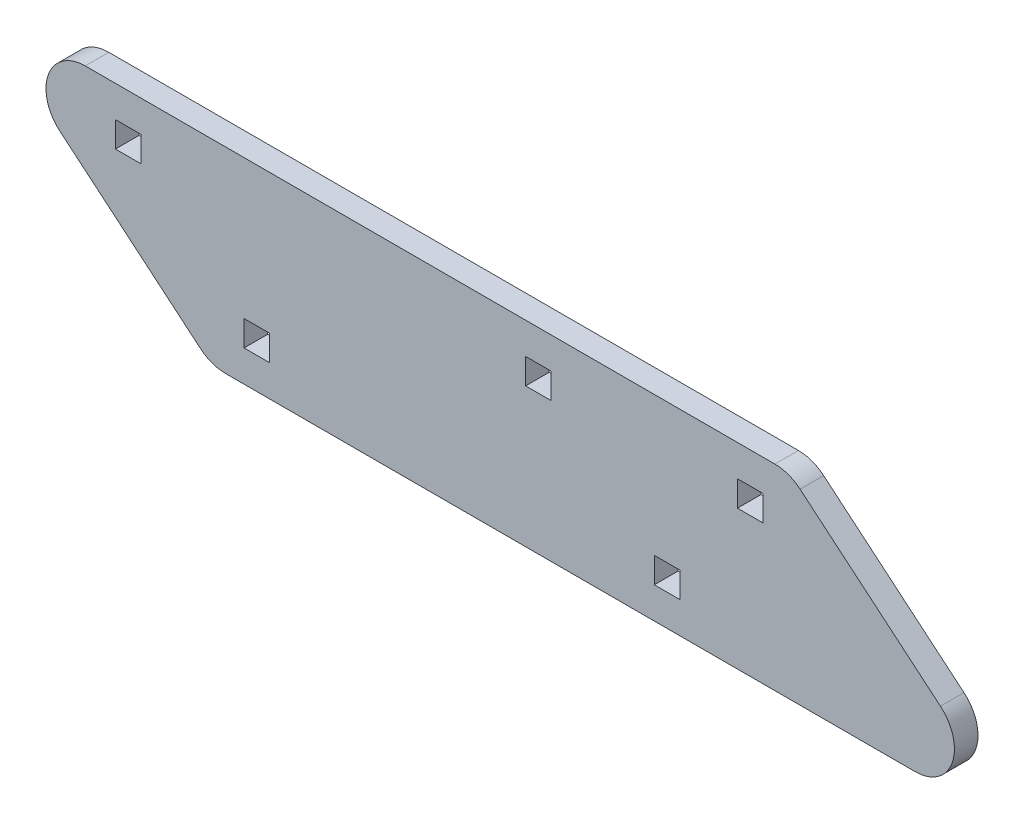
ISO-10303-21;
HEADER;
FILE_DESCRIPTION(('STEP AP214'),'2;1');
FILE_NAME('part.step','',(''),(''),'','','');
FILE_SCHEMA(('AUTOMOTIVE_DESIGN { 1 0 10303 214 1 1 1 1 }'));
ENDSEC;
DATA;
#1=APPLICATION_CONTEXT('core data for automotive mechanical design processes');
#2=APPLICATION_PROTOCOL_DEFINITION('international standard','automotive_design',2000,#1);
#3=PRODUCT_CONTEXT('',#1,'mechanical');
#4=PRODUCT('Part','Part','',(#3));
#5=PRODUCT_RELATED_PRODUCT_CATEGORY('part','',(#4));
#6=PRODUCT_DEFINITION_FORMATION('','',#4);
#7=PRODUCT_DEFINITION_CONTEXT('part definition',#1,'design');
#8=PRODUCT_DEFINITION('design','',#6,#7);
#9=PRODUCT_DEFINITION_SHAPE('','',#8);
#10=(LENGTH_UNIT() NAMED_UNIT(*) SI_UNIT(.MILLI.,.METRE.));
#11=(NAMED_UNIT(*) PLANE_ANGLE_UNIT() SI_UNIT($,.RADIAN.));
#12=(NAMED_UNIT(*) SI_UNIT($,.STERADIAN.) SOLID_ANGLE_UNIT());
#13=UNCERTAINTY_MEASURE_WITH_UNIT(LENGTH_MEASURE(1.E-05),#10,'distance_accuracy_value','');
#14=(GEOMETRIC_REPRESENTATION_CONTEXT(3) GLOBAL_UNCERTAINTY_ASSIGNED_CONTEXT((#13)) GLOBAL_UNIT_ASSIGNED_CONTEXT((#10,
#11,#12)) REPRESENTATION_CONTEXT('',''));
#15=CARTESIAN_POINT('',(0.,0.,0.));
#16=DIRECTION('',(0.,0.,1.));
#17=DIRECTION('',(1.,0.,0.));
#18=AXIS2_PLACEMENT_3D('',#15,#16,#17);
#19=CARTESIAN_POINT('',(74.7329856296232,13.7000000000001,56.0000000000001));
#20=DIRECTION('',(0.,-1.,0.));
#21=DIRECTION('',(0.,0.,1.));
#22=AXIS2_PLACEMENT_3D('',#19,#20,#21);
#23=PLANE('',#22);
#24=DIRECTION('',(-1.,0.,0.));
#25=VECTOR('',#24,1.);
#26=CARTESIAN_POINT('',(74.7329856296231,13.7,62.0000000000001));
#27=LINE('',#26,#25);
#28=CARTESIAN_POINT('',(11.5056036572506,13.7,62.0000000000001));
#29=VERTEX_POINT('',#28);
#30=CARTESIAN_POINT('',(-164.19224017583,13.7,62.0000000000001));
#31=VERTEX_POINT('',#30);
#32=EDGE_CURVE('E449',#29,#31,#27,.T.);
#33=ORIENTED_EDGE('',*,*,#32,.F.);
#34=DIRECTION('',(0.,0.,-1.));
#35=VECTOR('',#34,1.);
#36=CARTESIAN_POINT('',(11.5056036572506,13.7,62.0000000000001));
#37=LINE('',#36,#35);
#38=CARTESIAN_POINT('',(11.5056036572506,13.7000000000001,56.));
#39=VERTEX_POINT('',#38);
#40=EDGE_CURVE('E523',#39,#29,#37,.F.);
#41=ORIENTED_EDGE('',*,*,#40,.F.);
#42=DIRECTION('',(-1.,0.,0.));
#43=VECTOR('',#42,1.);
#44=CARTESIAN_POINT('',(74.7329856296232,13.7000000000001,56.0000000000001));
#45=LINE('',#44,#43);
#46=CARTESIAN_POINT('',(-164.19224017583,13.7,56.0000000000001));
#47=VERTEX_POINT('',#46);
#48=EDGE_CURVE('E461',#39,#47,#45,.T.);
#49=ORIENTED_EDGE('',*,*,#48,.T.);
#50=DIRECTION('',(0.,0.,-1.));
#51=VECTOR('',#50,1.);
#52=CARTESIAN_POINT('',(-164.19224017583,13.7,56.0000000000001));
#53=LINE('',#52,#51);
#54=EDGE_CURVE('E527',#31,#47,#53,.T.);
#55=ORIENTED_EDGE('',*,*,#54,.F.);
#56=EDGE_LOOP('',(#33,#41,#49,#55));
#57=FACE_BOUND('',#56,.T.);
#58=ADVANCED_FACE('F38',(#57),#23,.F.);
#59=CARTESIAN_POINT('',(74.7329856296232,13.7000000000001,56.0000000000001));
#60=DIRECTION('',(0.,0.,1.));
#61=DIRECTION('',(0.,1.,0.));
#62=AXIS2_PLACEMENT_3D('',#59,#60,#61);
#63=PLANE('',#62);
#64=DIRECTION('',(-1.,0.,0.));
#65=VECTOR('',#64,1.);
#66=CARTESIAN_POINT('',(74.7329856296232,5.70000000000009,56.0000000000001));
#67=LINE('',#66,#65);
#68=CARTESIAN_POINT('',(-150.009786453692,5.70000000000015,56.));
#69=VERTEX_POINT('',#68);
#70=CARTESIAN_POINT('',(-156.509786453692,5.69999999999998,56.0000000000001));
#71=VERTEX_POINT('',#70);
#72=EDGE_CURVE('E441',#69,#71,#67,.T.);
#73=ORIENTED_EDGE('',*,*,#72,.T.);
#74=DIRECTION('',(0.,-1.,0.));
#75=VECTOR('',#74,1.);
#76=CARTESIAN_POINT('',(-156.509786453692,13.7000000000001,56.0000000000001));
#77=LINE('',#76,#75);
#78=CARTESIAN_POINT('',(-156.509786453692,-0.799999999999912,56.));
#79=VERTEX_POINT('',#78);
#80=EDGE_CURVE('E445',#71,#79,#77,.T.);
#81=ORIENTED_EDGE('',*,*,#80,.T.);
#82=DIRECTION('',(1.,0.,0.));
#83=VECTOR('',#82,1.);
#84=CARTESIAN_POINT('',(74.7329856296231,-0.799999999999912,56.0000000000001));
#85=LINE('',#84,#83);
#86=CARTESIAN_POINT('',(-150.009786453692,-0.799999999999856,56.));
#87=VERTEX_POINT('',#86);
#88=EDGE_CURVE('E436',#79,#87,#85,.T.);
#89=ORIENTED_EDGE('',*,*,#88,.T.);
#90=DIRECTION('',(0.,1.,0.));
#91=VECTOR('',#90,1.);
#92=CARTESIAN_POINT('',(-150.009786453692,13.7000000000001,56.0000000000002));
#93=LINE('',#92,#91);
#94=EDGE_CURVE('E228',#87,#69,#93,.T.);
#95=ORIENTED_EDGE('',*,*,#94,.T.);
#96=EDGE_LOOP('',(#73,#81,#89,#95));
#97=FACE_BOUND('',#96,.T.);
#98=DIRECTION('',(1.,0.,0.));
#99=VECTOR('',#98,1.);
#100=CARTESIAN_POINT('',(74.7329856296232,-0.799999999999967,56.0000000000001));
#101=LINE('',#100,#99);
#102=CARTESIAN_POINT('',(-51.9897864536918,-0.799999999999856,56.));
#103=VERTEX_POINT('',#102);
#104=CARTESIAN_POINT('',(-45.4897864536918,-0.799999999999856,56.));
#105=VERTEX_POINT('',#104);
#106=EDGE_CURVE('E428',#103,#105,#101,.T.);
#107=ORIENTED_EDGE('',*,*,#106,.T.);
#108=DIRECTION('',(0.,1.,0.));
#109=VECTOR('',#108,1.);
#110=CARTESIAN_POINT('',(-45.4897864536918,13.7,56.0000000000001));
#111=LINE('',#110,#109);
#112=CARTESIAN_POINT('',(-45.4897864536918,5.70000000000004,56.));
#113=VERTEX_POINT('',#112);
#114=EDGE_CURVE('E432',#105,#113,#111,.T.);
#115=ORIENTED_EDGE('',*,*,#114,.T.);
#116=DIRECTION('',(-1.,0.,0.));
#117=VECTOR('',#116,1.);
#118=CARTESIAN_POINT('',(74.7329856296232,5.69999999999998,56.0000000000001));
#119=LINE('',#118,#117);
#120=CARTESIAN_POINT('',(-51.9897864536919,5.70000000000009,56.));
#121=VERTEX_POINT('',#120);
#122=EDGE_CURVE('E420',#113,#121,#119,.T.);
#123=ORIENTED_EDGE('',*,*,#122,.T.);
#124=DIRECTION('',(0.,-1.,0.));
#125=VECTOR('',#124,1.);
#126=CARTESIAN_POINT('',(-51.9897864536919,13.7000000000002,56.));
#127=LINE('',#126,#125);
#128=EDGE_CURVE('E424',#121,#103,#127,.T.);
#129=ORIENTED_EDGE('',*,*,#128,.T.);
#130=EDGE_LOOP('',(#107,#115,#123,#129));
#131=FACE_BOUND('',#130,.T.);
#132=DIRECTION('',(1.,0.,0.));
#133=VECTOR('',#132,1.);
#134=CARTESIAN_POINT('',(74.732985629623,-28.2999999999999,55.9999999999999));
#135=LINE('',#134,#133);
#136=CARTESIAN_POINT('',(-123.736562657351,-28.2999999999999,56.));
#137=VERTEX_POINT('',#136);
#138=CARTESIAN_POINT('',(-117.236562657351,-28.2999999999999,55.9999999999999));
#139=VERTEX_POINT('',#138);
#140=EDGE_CURVE('E412',#137,#139,#135,.T.);
#141=ORIENTED_EDGE('',*,*,#140,.T.);
#142=DIRECTION('',(0.,1.,0.));
#143=VECTOR('',#142,1.);
#144=CARTESIAN_POINT('',(-117.236562657351,13.7000000000002,56.0000000000001));
#145=LINE('',#144,#143);
#146=CARTESIAN_POINT('',(-117.236562657351,-21.7999999999999,56.));
#147=VERTEX_POINT('',#146);
#148=EDGE_CURVE('E416',#139,#147,#145,.T.);
#149=ORIENTED_EDGE('',*,*,#148,.T.);
#150=DIRECTION('',(-1.,0.,0.));
#151=VECTOR('',#150,1.);
#152=CARTESIAN_POINT('',(74.7329856296232,-21.8,55.9999999999999));
#153=LINE('',#152,#151);
#154=CARTESIAN_POINT('',(-123.736562657351,-21.7999999999999,56.));
#155=VERTEX_POINT('',#154);
#156=EDGE_CURVE('E404',#147,#155,#153,.T.);
#157=ORIENTED_EDGE('',*,*,#156,.T.);
#158=DIRECTION('',(0.,-1.,0.));
#159=VECTOR('',#158,1.);
#160=CARTESIAN_POINT('',(-123.736562657351,13.7000000000001,56.0000000000001));
#161=LINE('',#160,#159);
#162=EDGE_CURVE('E408',#155,#137,#161,.T.);
#163=ORIENTED_EDGE('',*,*,#162,.T.);
#164=EDGE_LOOP('',(#141,#149,#157,#163));
#165=FACE_BOUND('',#164,.T.);
#166=DIRECTION('',(1.,0.,0.));
#167=VECTOR('',#166,1.);
#168=CARTESIAN_POINT('',(74.732985629623,-28.2999999999999,55.9999999999999));
#169=LINE('',#168,#167);
#170=CARTESIAN_POINT('',(-19.2165626573512,-28.2999999999999,56.));
#171=VERTEX_POINT('',#170);
#172=CARTESIAN_POINT('',(-12.7165626573512,-28.2999999999999,55.9999999999999));
#173=VERTEX_POINT('',#172);
#174=EDGE_CURVE('E396',#171,#173,#169,.T.);
#175=ORIENTED_EDGE('',*,*,#174,.T.);
#176=DIRECTION('',(0.,1.,0.));
#177=VECTOR('',#176,1.);
#178=CARTESIAN_POINT('',(-12.7165626573509,13.7,56.0000000000001));
#179=LINE('',#178,#177);
#180=CARTESIAN_POINT('',(-12.716562657351,-21.8,55.9999999999999));
#181=VERTEX_POINT('',#180);
#182=EDGE_CURVE('E400',#173,#181,#179,.T.);
#183=ORIENTED_EDGE('',*,*,#182,.T.);
#184=DIRECTION('',(-1.,0.,0.));
#185=VECTOR('',#184,1.);
#186=CARTESIAN_POINT('',(74.7329856296232,-21.8,55.9999999999999));
#187=LINE('',#186,#185);
#188=CARTESIAN_POINT('',(-19.2165626573512,-21.7999999999999,55.9999999999999));
#189=VERTEX_POINT('',#188);
#190=EDGE_CURVE('E388',#181,#189,#187,.T.);
#191=ORIENTED_EDGE('',*,*,#190,.T.);
#192=DIRECTION('',(0.,-1.,0.));
#193=VECTOR('',#192,1.);
#194=CARTESIAN_POINT('',(-19.2165626573512,13.7000000000002,56.));
#195=LINE('',#194,#193);
#196=EDGE_CURVE('E392',#189,#171,#195,.T.);
#197=ORIENTED_EDGE('',*,*,#196,.T.);
#198=EDGE_LOOP('',(#175,#183,#191,#197));
#199=FACE_BOUND('',#198,.T.);
#200=DIRECTION('',(1.,0.,0.));
#201=VECTOR('',#200,1.);
#202=CARTESIAN_POINT('',(74.7329856296232,-0.799999999999967,56.0000000000001));
#203=LINE('',#202,#201);
#204=CARTESIAN_POINT('',(1.96667651369131,-0.799999999999967,56.0000000000001));
#205=VERTEX_POINT('',#204);
#206=CARTESIAN_POINT('',(8.46667651369126,-0.799999999999967,56.));
#207=VERTEX_POINT('',#206);
#208=EDGE_CURVE('E380',#205,#207,#203,.T.);
#209=ORIENTED_EDGE('',*,*,#208,.T.);
#210=DIRECTION('',(0.,1.,0.));
#211=VECTOR('',#210,1.);
#212=CARTESIAN_POINT('',(8.46667651369126,13.7000000000001,56.0000000000001));
#213=LINE('',#212,#211);
#214=CARTESIAN_POINT('',(8.46667651369126,5.70000000000009,56.));
#215=VERTEX_POINT('',#214);
#216=EDGE_CURVE('E384',#207,#215,#213,.T.);
#217=ORIENTED_EDGE('',*,*,#216,.T.);
#218=DIRECTION('',(-1.,0.,0.));
#219=VECTOR('',#218,1.);
#220=CARTESIAN_POINT('',(74.7329856296232,5.69999999999998,56.0000000000001));
#221=LINE('',#220,#219);
#222=CARTESIAN_POINT('',(1.96667651369126,5.70000000000009,56.0000000000001));
#223=VERTEX_POINT('',#222);
#224=EDGE_CURVE('E258',#215,#223,#221,.T.);
#225=ORIENTED_EDGE('',*,*,#224,.T.);
#226=DIRECTION('',(0.,-1.,0.));
#227=VECTOR('',#226,1.);
#228=CARTESIAN_POINT('',(1.96667651369131,13.7000000000001,56.));
#229=LINE('',#228,#227);
#230=EDGE_CURVE('E376',#223,#205,#229,.T.);
#231=ORIENTED_EDGE('',*,*,#230,.T.);
#232=EDGE_LOOP('',(#209,#217,#225,#231));
#233=FACE_BOUND('',#232,.T.);
#234=DIRECTION('',(0.766044443118977,-0.64278760968654,0.));
#235=VECTOR('',#234,1.);
#236=CARTESIAN_POINT('',(-132.079334740666,-36.2999999999999,55.9999999999999));
#237=LINE('',#236,#235);
#238=CARTESIAN_POINT('',(-170.620116272696,-3.96044443118965,56.));
#239=VERTEX_POINT('',#238);
#240=CARTESIAN_POINT('',(-134.86750849487,-33.9604444311897,55.9999999999999));
#241=VERTEX_POINT('',#240);
#242=EDGE_CURVE('E465',#239,#241,#237,.T.);
#243=ORIENTED_EDGE('',*,*,#242,.F.);
#244=CARTESIAN_POINT('',(-164.19224017583,3.70000000000004,56.));
#245=DIRECTION('',(0.,0.,-1.));
#246=DIRECTION('',(0.,1.,0.));
#247=AXIS2_PLACEMENT_3D('',#244,#245,#246);
#248=CIRCLE('',#247,10.);
#249=EDGE_CURVE('E515',#47,#239,#248,.F.);
#250=ORIENTED_EDGE('',*,*,#249,.F.);
#251=ORIENTED_EDGE('',*,*,#48,.F.);
#252=CARTESIAN_POINT('',(11.5056036572506,3.70000000000009,56.));
#253=DIRECTION('',(0.,0.,-1.));
#254=DIRECTION('',(0.,1.,0.));
#255=AXIS2_PLACEMENT_3D('',#252,#253,#254);
#256=CIRCLE('',#255,10.);
#257=CARTESIAN_POINT('',(17.9334797541161,11.3604444311897,56.0000000000001));
#258=VERTEX_POINT('',#257);
#259=EDGE_CURVE('E508',#258,#39,#256,.F.);
#260=ORIENTED_EDGE('',*,*,#259,.F.);
#261=DIRECTION('',(0.766044443118977,-0.642787609686541,0.));
#262=VECTOR('',#261,1.);
#263=CARTESIAN_POINT('',(74.7329856296232,-36.3000000000001,55.9999999999999));
#264=LINE('',#263,#262);
#265=CARTESIAN_POINT('',(53.6860875319423,-18.6395555688101,56.));
#266=VERTEX_POINT('',#265);
#267=EDGE_CURVE('E469',#266,#258,#264,.F.);
#268=ORIENTED_EDGE('',*,*,#267,.F.);
#269=CARTESIAN_POINT('',(47.2582114350767,-26.2999999999998,55.9999999999999));
#270=DIRECTION('',(0.,0.,-1.));
#271=DIRECTION('',(0.,1.,0.));
#272=AXIS2_PLACEMENT_3D('',#269,#270,#271);
#273=CIRCLE('',#272,10.);
#274=CARTESIAN_POINT('',(47.2582114350767,-36.2999999999999,56.));
#275=VERTEX_POINT('',#274);
#276=EDGE_CURVE('E511',#275,#266,#273,.F.);
#277=ORIENTED_EDGE('',*,*,#276,.F.);
#278=DIRECTION('',(-1.,0.,0.));
#279=VECTOR('',#278,1.);
#280=CARTESIAN_POINT('',(74.7329856296231,-36.2999999999999,55.9999999999999));
#281=LINE('',#280,#279);
#282=CARTESIAN_POINT('',(-128.439632398004,-36.2999999999999,55.9999999999999));
#283=VERTEX_POINT('',#282);
#284=EDGE_CURVE('E457',#275,#283,#281,.T.);
#285=ORIENTED_EDGE('',*,*,#284,.T.);
#286=CARTESIAN_POINT('',(-128.439632398004,-26.2999999999999,55.9999999999999));
#287=DIRECTION('',(0.,0.,-1.));
#288=DIRECTION('',(0.,1.,0.));
#289=AXIS2_PLACEMENT_3D('',#286,#287,#288);
#290=CIRCLE('',#289,10.);
#291=EDGE_CURVE('E519',#241,#283,#290,.F.);
#292=ORIENTED_EDGE('',*,*,#291,.F.);
#293=EDGE_LOOP('',(#243,#250,#251,#260,#268,#277,#285,#292));
#294=FACE_BOUND('',#293,.T.);
#295=ADVANCED_FACE('F543',(#97,#131,#165,#199,#233,#294),#63,.F.);
#296=CARTESIAN_POINT('',(74.7329856296232,-36.3,61.9999999999999));
#297=DIRECTION('',(0.,1.,0.));
#298=DIRECTION('',(0.,0.,-1.));
#299=AXIS2_PLACEMENT_3D('',#296,#297,#298);
#300=PLANE('',#299);
#301=ORIENTED_EDGE('',*,*,#284,.F.);
#302=DIRECTION('',(0.,0.,-1.));
#303=VECTOR('',#302,1.);
#304=CARTESIAN_POINT('',(47.2582114350767,-36.2999999999999,56.));
#305=LINE('',#304,#303);
#306=CARTESIAN_POINT('',(47.2582114350768,-36.3000000000001,61.9999999999999));
#307=VERTEX_POINT('',#306);
#308=EDGE_CURVE('E481',#307,#275,#305,.T.);
#309=ORIENTED_EDGE('',*,*,#308,.F.);
#310=DIRECTION('',(-1.,0.,0.));
#311=VECTOR('',#310,1.);
#312=CARTESIAN_POINT('',(74.7329856296232,-36.3,61.9999999999999));
#313=LINE('',#312,#311);
#314=CARTESIAN_POINT('',(-128.439632398004,-36.3000000000001,61.9999999999999));
#315=VERTEX_POINT('',#314);
#316=EDGE_CURVE('E453',#307,#315,#313,.T.);
#317=ORIENTED_EDGE('',*,*,#316,.T.);
#318=DIRECTION('',(0.,0.,1.));
#319=VECTOR('',#318,1.);
#320=CARTESIAN_POINT('',(-128.439632398004,-36.3000000000001,61.9999999999999));
#321=LINE('',#320,#319);
#322=EDGE_CURVE('E484',#283,#315,#321,.T.);
#323=ORIENTED_EDGE('',*,*,#322,.F.);
#324=EDGE_LOOP('',(#301,#309,#317,#323));
#325=FACE_BOUND('',#324,.T.);
#326=ADVANCED_FACE('F559',(#325),#300,.F.);
#327=CARTESIAN_POINT('',(74.7329856296231,13.7,62.0000000000001));
#328=DIRECTION('',(0.,0.,-1.));
#329=DIRECTION('',(0.,-1.,0.));
#330=AXIS2_PLACEMENT_3D('',#327,#328,#329);
#331=PLANE('',#330);
#332=DIRECTION('',(1.,0.,0.));
#333=VECTOR('',#332,1.);
#334=CARTESIAN_POINT('',(-150.009786453692,-0.799999999999967,62.0000000000001));
#335=LINE('',#334,#333);
#336=CARTESIAN_POINT('',(-156.509786453692,-0.800000000000078,62.));
#337=VERTEX_POINT('',#336);
#338=CARTESIAN_POINT('',(-150.009786453692,-0.799999999999967,62.0000000000001));
#339=VERTEX_POINT('',#338);
#340=EDGE_CURVE('E236',#337,#339,#335,.T.);
#341=ORIENTED_EDGE('',*,*,#340,.F.);
#342=DIRECTION('',(0.,-1.,0.));
#343=VECTOR('',#342,1.);
#344=CARTESIAN_POINT('',(-156.509786453692,-0.800000000000078,62.0000000000001));
#345=LINE('',#344,#343);
#346=CARTESIAN_POINT('',(-156.509786453692,5.69999999999998,62.0000000000001));
#347=VERTEX_POINT('',#346);
#348=EDGE_CURVE('E242',#347,#337,#345,.T.);
#349=ORIENTED_EDGE('',*,*,#348,.F.);
#350=DIRECTION('',(-1.,0.,0.));
#351=VECTOR('',#350,1.);
#352=CARTESIAN_POINT('',(-150.009786453692,5.70000000000004,62.0000000000001));
#353=LINE('',#352,#351);
#354=CARTESIAN_POINT('',(-150.009786453692,5.70000000000004,62.0000000000001));
#355=VERTEX_POINT('',#354);
#356=EDGE_CURVE('E247',#355,#347,#353,.T.);
#357=ORIENTED_EDGE('',*,*,#356,.F.);
#358=DIRECTION('',(0.,1.,0.));
#359=VECTOR('',#358,1.);
#360=CARTESIAN_POINT('',(-150.009786453692,-0.799999999999967,62.0000000000001));
#361=LINE('',#360,#359);
#362=EDGE_CURVE('E225',#339,#355,#361,.T.);
#363=ORIENTED_EDGE('',*,*,#362,.F.);
#364=EDGE_LOOP('',(#341,#349,#357,#363));
#365=FACE_BOUND('',#364,.T.);
#366=DIRECTION('',(-1.,0.,0.));
#367=VECTOR('',#366,1.);
#368=CARTESIAN_POINT('',(-51.9897864536918,5.69999999999998,62.0000000000001));
#369=LINE('',#368,#367);
#370=CARTESIAN_POINT('',(-45.4897864536918,5.70000000000004,62.));
#371=VERTEX_POINT('',#370);
#372=CARTESIAN_POINT('',(-51.9897864536918,5.69999999999998,62.0000000000001));
#373=VERTEX_POINT('',#372);
#374=EDGE_CURVE('E266',#371,#373,#369,.T.);
#375=ORIENTED_EDGE('',*,*,#374,.F.);
#376=DIRECTION('',(0.,1.,0.));
#377=VECTOR('',#376,1.);
#378=CARTESIAN_POINT('',(-45.4897864536918,-0.799999999999912,62.0000000000001));
#379=LINE('',#378,#377);
#380=CARTESIAN_POINT('',(-45.4897864536918,-0.799999999999912,62.0000000000001));
#381=VERTEX_POINT('',#380);
#382=EDGE_CURVE('E263',#381,#371,#379,.T.);
#383=ORIENTED_EDGE('',*,*,#382,.F.);
#384=DIRECTION('',(1.,0.,0.));
#385=VECTOR('',#384,1.);
#386=CARTESIAN_POINT('',(-51.9897864536917,-0.800000000000023,62.0000000000001));
#387=LINE('',#386,#385);
#388=CARTESIAN_POINT('',(-51.9897864536917,-0.800000000000023,62.0000000000001));
#389=VERTEX_POINT('',#388);
#390=EDGE_CURVE('E274',#389,#381,#387,.T.);
#391=ORIENTED_EDGE('',*,*,#390,.F.);
#392=DIRECTION('',(0.,-1.,0.));
#393=VECTOR('',#392,1.);
#394=CARTESIAN_POINT('',(-51.9897864536917,-0.800000000000023,62.0000000000001));
#395=LINE('',#394,#393);
#396=EDGE_CURVE('E270',#373,#389,#395,.T.);
#397=ORIENTED_EDGE('',*,*,#396,.F.);
#398=EDGE_LOOP('',(#375,#383,#391,#397));
#399=FACE_BOUND('',#398,.T.);
#400=DIRECTION('',(-1.,0.,0.));
#401=VECTOR('',#400,1.);
#402=CARTESIAN_POINT('',(-123.736562657351,-21.8,62.0000000000001));
#403=LINE('',#402,#401);
#404=CARTESIAN_POINT('',(-117.236562657351,-21.7999999999999,62.));
#405=VERTEX_POINT('',#404);
#406=CARTESIAN_POINT('',(-123.736562657351,-21.8,62.0000000000001));
#407=VERTEX_POINT('',#406);
#408=EDGE_CURVE('E293',#405,#407,#403,.T.);
#409=ORIENTED_EDGE('',*,*,#408,.F.);
#410=DIRECTION('',(0.,1.,0.));
#411=VECTOR('',#410,1.);
#412=CARTESIAN_POINT('',(-117.236562657351,-28.3000000000001,62.0000000000001));
#413=LINE('',#412,#411);
#414=CARTESIAN_POINT('',(-117.236562657351,-28.3000000000001,62.0000000000001));
#415=VERTEX_POINT('',#414);
#416=EDGE_CURVE('E290',#415,#405,#413,.T.);
#417=ORIENTED_EDGE('',*,*,#416,.F.);
#418=DIRECTION('',(1.,0.,0.));
#419=VECTOR('',#418,1.);
#420=CARTESIAN_POINT('',(-123.736562657351,-28.3,62.0000000000001));
#421=LINE('',#420,#419);
#422=CARTESIAN_POINT('',(-123.736562657351,-28.3,62.0000000000001));
#423=VERTEX_POINT('',#422);
#424=EDGE_CURVE('E302',#423,#415,#421,.T.);
#425=ORIENTED_EDGE('',*,*,#424,.F.);
#426=DIRECTION('',(0.,-1.,0.));
#427=VECTOR('',#426,1.);
#428=CARTESIAN_POINT('',(-123.736562657351,-28.3,62.0000000000001));
#429=LINE('',#428,#427);
#430=EDGE_CURVE('E298',#407,#423,#429,.T.);
#431=ORIENTED_EDGE('',*,*,#430,.F.);
#432=EDGE_LOOP('',(#409,#417,#425,#431));
#433=FACE_BOUND('',#432,.T.);
#434=DIRECTION('',(-1.,0.,0.));
#435=VECTOR('',#434,1.);
#436=CARTESIAN_POINT('',(-19.2165626573512,-21.7999999999999,62.));
#437=LINE('',#436,#435);
#438=CARTESIAN_POINT('',(-12.7165626573511,-21.8,61.9999999999999));
#439=VERTEX_POINT('',#438);
#440=CARTESIAN_POINT('',(-19.2165626573512,-21.7999999999999,62.));
#441=VERTEX_POINT('',#440);
#442=EDGE_CURVE('E321',#439,#441,#437,.T.);
#443=ORIENTED_EDGE('',*,*,#442,.F.);
#444=DIRECTION('',(0.,1.,0.));
#445=VECTOR('',#444,1.);
#446=CARTESIAN_POINT('',(-12.7165626573511,-28.3,62.0000000000001));
#447=LINE('',#446,#445);
#448=CARTESIAN_POINT('',(-12.7165626573511,-28.3,62.0000000000001));
#449=VERTEX_POINT('',#448);
#450=EDGE_CURVE('E318',#449,#439,#447,.T.);
#451=ORIENTED_EDGE('',*,*,#450,.F.);
#452=DIRECTION('',(1.,0.,0.));
#453=VECTOR('',#452,1.);
#454=CARTESIAN_POINT('',(-19.2165626573511,-28.3000000000001,62.0000000000001));
#455=LINE('',#454,#453);
#456=CARTESIAN_POINT('',(-19.2165626573511,-28.3000000000001,62.0000000000001));
#457=VERTEX_POINT('',#456);
#458=EDGE_CURVE('E330',#457,#449,#455,.T.);
#459=ORIENTED_EDGE('',*,*,#458,.F.);
#460=DIRECTION('',(0.,-1.,0.));
#461=VECTOR('',#460,1.);
#462=CARTESIAN_POINT('',(-19.2165626573511,-28.3000000000001,62.0000000000001));
#463=LINE('',#462,#461);
#464=EDGE_CURVE('E326',#441,#457,#463,.T.);
#465=ORIENTED_EDGE('',*,*,#464,.F.);
#466=EDGE_LOOP('',(#443,#451,#459,#465));
#467=FACE_BOUND('',#466,.T.);
#468=DIRECTION('',(-1.,0.,0.));
#469=VECTOR('',#468,1.);
#470=CARTESIAN_POINT('',(1.96667651369126,5.70000000000004,62.0000000000001));
#471=LINE('',#470,#469);
#472=CARTESIAN_POINT('',(8.46667651369132,5.69999999999998,62.));
#473=VERTEX_POINT('',#472);
#474=CARTESIAN_POINT('',(1.96667651369126,5.70000000000004,62.0000000000001));
#475=VERTEX_POINT('',#474);
#476=EDGE_CURVE('E349',#473,#475,#471,.T.);
#477=ORIENTED_EDGE('',*,*,#476,.F.);
#478=DIRECTION('',(0.,1.,0.));
#479=VECTOR('',#478,1.);
#480=CARTESIAN_POINT('',(8.46667651369137,-0.800000000000023,62.0000000000001));
#481=LINE('',#480,#479);
#482=CARTESIAN_POINT('',(8.46667651369137,-0.800000000000023,62.0000000000001));
#483=VERTEX_POINT('',#482);
#484=EDGE_CURVE('E346',#483,#473,#481,.T.);
#485=ORIENTED_EDGE('',*,*,#484,.F.);
#486=DIRECTION('',(1.,0.,0.));
#487=VECTOR('',#486,1.);
#488=CARTESIAN_POINT('',(1.96667651369137,-0.800000000000078,62.0000000000001));
#489=LINE('',#488,#487);
#490=CARTESIAN_POINT('',(1.96667651369137,-0.800000000000078,62.0000000000001));
#491=VERTEX_POINT('',#490);
#492=EDGE_CURVE('E357',#491,#483,#489,.T.);
#493=ORIENTED_EDGE('',*,*,#492,.F.);
#494=DIRECTION('',(0.,-1.,0.));
#495=VECTOR('',#494,1.);
#496=CARTESIAN_POINT('',(1.96667651369137,-0.800000000000078,62.0000000000001));
#497=LINE('',#496,#495);
#498=EDGE_CURVE('E353',#475,#491,#497,.T.);
#499=ORIENTED_EDGE('',*,*,#498,.F.);
#500=EDGE_LOOP('',(#477,#485,#493,#499));
#501=FACE_BOUND('',#500,.T.);
#502=ORIENTED_EDGE('',*,*,#316,.F.);
#503=CARTESIAN_POINT('',(47.2582114350768,-26.3,61.9999999999999));
#504=DIRECTION('',(0.,0.,1.));
#505=DIRECTION('',(0.,-1.,0.));
#506=AXIS2_PLACEMENT_3D('',#503,#504,#505);
#507=CIRCLE('',#506,10.);
#508=CARTESIAN_POINT('',(53.6860875319421,-18.6395555688102,61.9999999999999));
#509=VERTEX_POINT('',#508);
#510=EDGE_CURVE('E492',#509,#307,#507,.F.);
#511=ORIENTED_EDGE('',*,*,#510,.F.);
#512=DIRECTION('',(-0.766044443118977,0.642787609686541,0.));
#513=VECTOR('',#512,1.);
#514=CARTESIAN_POINT('',(74.7329856296232,-36.3000000000003,61.9999999999999));
#515=LINE('',#514,#513);
#516=CARTESIAN_POINT('',(17.9334797541161,11.3604444311897,62.0000000000001));
#517=VERTEX_POINT('',#516);
#518=EDGE_CURVE('E477',#517,#509,#515,.F.);
#519=ORIENTED_EDGE('',*,*,#518,.F.);
#520=CARTESIAN_POINT('',(11.5056036572507,3.69999999999993,62.0000000000001));
#521=DIRECTION('',(0.,0.,1.));
#522=DIRECTION('',(0.,-1.,0.));
#523=AXIS2_PLACEMENT_3D('',#520,#521,#522);
#524=CIRCLE('',#523,10.);
#525=EDGE_CURVE('E488',#29,#517,#524,.F.);
#526=ORIENTED_EDGE('',*,*,#525,.F.);
#527=ORIENTED_EDGE('',*,*,#32,.T.);
#528=CARTESIAN_POINT('',(-164.19224017583,3.69999999999987,62.));
#529=DIRECTION('',(0.,0.,1.));
#530=DIRECTION('',(0.,-1.,0.));
#531=AXIS2_PLACEMENT_3D('',#528,#529,#530);
#532=CIRCLE('',#531,10.);
#533=CARTESIAN_POINT('',(-170.620116272696,-3.96044443118981,62.));
#534=VERTEX_POINT('',#533);
#535=EDGE_CURVE('E495',#534,#31,#532,.F.);
#536=ORIENTED_EDGE('',*,*,#535,.F.);
#537=DIRECTION('',(-0.766044443118977,0.64278760968654,0.));
#538=VECTOR('',#537,1.);
#539=CARTESIAN_POINT('',(-132.079334740666,-36.3000000000001,61.9999999999999));
#540=LINE('',#539,#538);
#541=CARTESIAN_POINT('',(-134.86750849487,-33.9604444311897,61.9999999999999));
#542=VERTEX_POINT('',#541);
#543=EDGE_CURVE('E473',#542,#534,#540,.T.);
#544=ORIENTED_EDGE('',*,*,#543,.F.);
#545=CARTESIAN_POINT('',(-128.439632398004,-26.3,61.9999999999999));
#546=DIRECTION('',(0.,0.,1.));
#547=DIRECTION('',(0.,-1.,0.));
#548=AXIS2_PLACEMENT_3D('',#545,#546,#547);
#549=CIRCLE('',#548,10.);
#550=EDGE_CURVE('E498',#315,#542,#549,.F.);
#551=ORIENTED_EDGE('',*,*,#550,.F.);
#552=EDGE_LOOP('',(#502,#511,#519,#526,#527,#536,#544,#551));
#553=FACE_BOUND('',#552,.T.);
#554=ADVANCED_FACE('F244',(#365,#399,#433,#467,#501,#553),#331,.F.);
#555=CARTESIAN_POINT('',(74.7329856296231,-36.3000000000002,109.));
#556=DIRECTION('',(-0.642787609686541,-0.766044443118977,0.));
#557=DIRECTION('',(0.,0.,-1.));
#558=AXIS2_PLACEMENT_3D('',#555,#556,#557);
#559=PLANE('',#558);
#560=ORIENTED_EDGE('',*,*,#267,.T.);
#561=DIRECTION('',(0.,0.,1.));
#562=VECTOR('',#561,1.);
#563=CARTESIAN_POINT('',(17.933479754116,11.3604444311899,56.0000000000001));
#564=LINE('',#563,#562);
#565=EDGE_CURVE('E47',#517,#258,#564,.F.);
#566=ORIENTED_EDGE('',*,*,#565,.F.);
#567=ORIENTED_EDGE('',*,*,#518,.T.);
#568=DIRECTION('',(0.,0.,1.));
#569=VECTOR('',#568,1.);
#570=CARTESIAN_POINT('',(53.6860875319421,-18.6395555688102,61.9999999999999));
#571=LINE('',#570,#569);
#572=EDGE_CURVE('E11',#266,#509,#571,.T.);
#573=ORIENTED_EDGE('',*,*,#572,.F.);
#574=EDGE_LOOP('',(#560,#566,#567,#573));
#575=FACE_BOUND('',#574,.T.);
#576=ADVANCED_FACE('F539',(#575),#559,.F.);
#577=CARTESIAN_POINT('',(-132.079334740666,-36.3000000000001,61.9999999999999));
#578=DIRECTION('',(-0.64278760968654,-0.766044443118977,0.));
#579=DIRECTION('',(0.,0.,-1.));
#580=AXIS2_PLACEMENT_3D('',#577,#578,#579);
#581=PLANE('',#580);
#582=ORIENTED_EDGE('',*,*,#543,.T.);
#583=DIRECTION('',(0.,0.,-1.));
#584=VECTOR('',#583,1.);
#585=CARTESIAN_POINT('',(-170.620116272696,-3.96044443118976,62.));
#586=LINE('',#585,#584);
#587=EDGE_CURVE('E502',#239,#534,#586,.F.);
#588=ORIENTED_EDGE('',*,*,#587,.F.);
#589=ORIENTED_EDGE('',*,*,#242,.T.);
#590=DIRECTION('',(0.,0.,1.));
#591=VECTOR('',#590,1.);
#592=CARTESIAN_POINT('',(-134.86750849487,-33.9604444311897,55.9999999999999));
#593=LINE('',#592,#591);
#594=EDGE_CURVE('E505',#542,#241,#593,.F.);
#595=ORIENTED_EDGE('',*,*,#594,.F.);
#596=EDGE_LOOP('',(#582,#588,#589,#595));
#597=FACE_BOUND('',#596,.T.);
#598=ADVANCED_FACE('F563',(#597),#581,.T.);
#599=CARTESIAN_POINT('',(-128.439632398004,-26.3,61.9999999999999));
#600=DIRECTION('',(0.,0.,-1.));
#601=DIRECTION('',(0.,-1.,0.));
#602=AXIS2_PLACEMENT_3D('',#599,#600,#601);
#603=CYLINDRICAL_SURFACE('',#602,10.);
#604=ORIENTED_EDGE('',*,*,#291,.T.);
#605=ORIENTED_EDGE('',*,*,#322,.T.);
#606=ORIENTED_EDGE('',*,*,#550,.T.);
#607=ORIENTED_EDGE('',*,*,#594,.T.);
#608=EDGE_LOOP('',(#604,#605,#606,#607));
#609=FACE_BOUND('',#608,.T.);
#610=ADVANCED_FACE('F561',(#609),#603,.T.);
#611=CARTESIAN_POINT('',(-164.19224017583,3.70000000000004,56.));
#612=DIRECTION('',(0.,0.,1.));
#613=DIRECTION('',(0.,1.,0.));
#614=AXIS2_PLACEMENT_3D('',#611,#612,#613);
#615=CYLINDRICAL_SURFACE('',#614,10.);
#616=ORIENTED_EDGE('',*,*,#535,.T.);
#617=ORIENTED_EDGE('',*,*,#54,.T.);
#618=ORIENTED_EDGE('',*,*,#249,.T.);
#619=ORIENTED_EDGE('',*,*,#587,.T.);
#620=EDGE_LOOP('',(#616,#617,#618,#619));
#621=FACE_BOUND('',#620,.T.);
#622=ADVANCED_FACE('F565',(#621),#615,.T.);
#623=CARTESIAN_POINT('',(47.2582114350768,-26.3000000000002,109.));
#624=DIRECTION('',(0.,0.,1.));
#625=DIRECTION('',(0.,1.,0.));
#626=AXIS2_PLACEMENT_3D('',#623,#624,#625);
#627=CYLINDRICAL_SURFACE('',#626,10.);
#628=ORIENTED_EDGE('',*,*,#276,.T.);
#629=ORIENTED_EDGE('',*,*,#572,.T.);
#630=ORIENTED_EDGE('',*,*,#510,.T.);
#631=ORIENTED_EDGE('',*,*,#308,.T.);
#632=EDGE_LOOP('',(#628,#629,#630,#631));
#633=FACE_BOUND('',#632,.T.);
#634=ADVANCED_FACE('F555',(#633),#627,.T.);
#635=CARTESIAN_POINT('',(11.5056036572506,3.70000000000009,56.));
#636=DIRECTION('',(0.,0.,1.));
#637=DIRECTION('',(0.,1.,0.));
#638=AXIS2_PLACEMENT_3D('',#635,#636,#637);
#639=CYLINDRICAL_SURFACE('',#638,10.);
#640=ORIENTED_EDGE('',*,*,#259,.T.);
#641=ORIENTED_EDGE('',*,*,#40,.T.);
#642=ORIENTED_EDGE('',*,*,#525,.T.);
#643=ORIENTED_EDGE('',*,*,#565,.T.);
#644=EDGE_LOOP('',(#640,#641,#642,#643));
#645=FACE_BOUND('',#644,.T.);
#646=ADVANCED_FACE('F40',(#645),#639,.T.);
#647=CARTESIAN_POINT('',(8.46667651369137,-0.799999999999967,-50.));
#648=DIRECTION('',(1.,0.,0.));
#649=DIRECTION('',(0.,0.,-1.));
#650=AXIS2_PLACEMENT_3D('',#647,#648,#649);
#651=PLANE('',#650);
#652=DIRECTION('',(0.,0.,1.));
#653=VECTOR('',#652,1.);
#654=CARTESIAN_POINT('',(8.46667651369137,-0.799999999999967,-50.));
#655=LINE('',#654,#653);
#656=EDGE_CURVE('E322',#207,#483,#655,.T.);
#657=ORIENTED_EDGE('',*,*,#656,.T.);
#658=ORIENTED_EDGE('',*,*,#484,.T.);
#659=DIRECTION('',(0.,0.,1.));
#660=VECTOR('',#659,1.);
#661=CARTESIAN_POINT('',(8.46667651369132,5.69999999999998,-50.));
#662=LINE('',#661,#660);
#663=EDGE_CURVE('E361',#215,#473,#662,.T.);
#664=ORIENTED_EDGE('',*,*,#663,.F.);
#665=ORIENTED_EDGE('',*,*,#216,.F.);
#666=EDGE_LOOP('',(#657,#658,#664,#665));
#667=FACE_BOUND('',#666,.T.);
#668=ADVANCED_FACE('F616',(#667),#651,.F.);
#669=CARTESIAN_POINT('',(1.96667651369142,-0.800000000000023,-50.));
#670=DIRECTION('',(0.,-1.,0.));
#671=DIRECTION('',(0.,0.,-1.));
#672=AXIS2_PLACEMENT_3D('',#669,#670,#671);
#673=PLANE('',#672);
#674=DIRECTION('',(0.,0.,1.));
#675=VECTOR('',#674,1.);
#676=CARTESIAN_POINT('',(1.96667651369142,-0.800000000000023,-50.));
#677=LINE('',#676,#675);
#678=EDGE_CURVE('E364',#205,#491,#677,.T.);
#679=ORIENTED_EDGE('',*,*,#678,.T.);
#680=ORIENTED_EDGE('',*,*,#492,.T.);
#681=ORIENTED_EDGE('',*,*,#656,.F.);
#682=ORIENTED_EDGE('',*,*,#208,.F.);
#683=EDGE_LOOP('',(#679,#680,#681,#682));
#684=FACE_BOUND('',#683,.T.);
#685=ADVANCED_FACE('F625',(#684),#673,.F.);
#686=CARTESIAN_POINT('',(1.96667651369142,-0.800000000000023,-50.));
#687=DIRECTION('',(-1.,0.,0.));
#688=DIRECTION('',(0.,0.,1.));
#689=AXIS2_PLACEMENT_3D('',#686,#687,#688);
#690=PLANE('',#689);
#691=DIRECTION('',(0.,0.,1.));
#692=VECTOR('',#691,1.);
#693=CARTESIAN_POINT('',(1.96667651369131,5.70000000000009,-50.));
#694=LINE('',#693,#692);
#695=EDGE_CURVE('E367',#223,#475,#694,.T.);
#696=ORIENTED_EDGE('',*,*,#695,.T.);
#697=ORIENTED_EDGE('',*,*,#498,.T.);
#698=ORIENTED_EDGE('',*,*,#678,.F.);
#699=ORIENTED_EDGE('',*,*,#230,.F.);
#700=EDGE_LOOP('',(#696,#697,#698,#699));
#701=FACE_BOUND('',#700,.T.);
#702=ADVANCED_FACE('F636',(#701),#690,.F.);
#703=CARTESIAN_POINT('',(1.96667651369131,5.70000000000009,-50.));
#704=DIRECTION('',(0.,1.,0.));
#705=DIRECTION('',(0.,0.,1.));
#706=AXIS2_PLACEMENT_3D('',#703,#704,#705);
#707=PLANE('',#706);
#708=ORIENTED_EDGE('',*,*,#663,.T.);
#709=ORIENTED_EDGE('',*,*,#476,.T.);
#710=ORIENTED_EDGE('',*,*,#695,.F.);
#711=ORIENTED_EDGE('',*,*,#224,.F.);
#712=EDGE_LOOP('',(#708,#709,#710,#711));
#713=FACE_BOUND('',#712,.T.);
#714=ADVANCED_FACE('F647',(#713),#707,.F.);
#715=CARTESIAN_POINT('',(-12.7165626573509,-28.3,-50.));
#716=DIRECTION('',(1.,0.,0.));
#717=DIRECTION('',(0.,0.,-1.));
#718=AXIS2_PLACEMENT_3D('',#715,#716,#717);
#719=PLANE('',#718);
#720=DIRECTION('',(0.,0.,1.));
#721=VECTOR('',#720,1.);
#722=CARTESIAN_POINT('',(-12.7165626573509,-28.3,-50.));
#723=LINE('',#722,#721);
#724=EDGE_CURVE('E294',#173,#449,#723,.T.);
#725=ORIENTED_EDGE('',*,*,#724,.T.);
#726=ORIENTED_EDGE('',*,*,#450,.T.);
#727=DIRECTION('',(0.,0.,1.));
#728=VECTOR('',#727,1.);
#729=CARTESIAN_POINT('',(-12.7165626573509,-21.7999999999999,-50.));
#730=LINE('',#729,#728);
#731=EDGE_CURVE('E334',#181,#439,#730,.T.);
#732=ORIENTED_EDGE('',*,*,#731,.F.);
#733=ORIENTED_EDGE('',*,*,#182,.F.);
#734=EDGE_LOOP('',(#725,#726,#732,#733));
#735=FACE_BOUND('',#734,.T.);
#736=ADVANCED_FACE('F658',(#735),#719,.F.);
#737=CARTESIAN_POINT('',(-19.216562657351,-28.2999999999999,-50.));
#738=DIRECTION('',(0.,-1.,0.));
#739=DIRECTION('',(0.,0.,-1.));
#740=AXIS2_PLACEMENT_3D('',#737,#738,#739);
#741=PLANE('',#740);
#742=DIRECTION('',(0.,0.,1.));
#743=VECTOR('',#742,1.);
#744=CARTESIAN_POINT('',(-19.216562657351,-28.2999999999999,-50.));
#745=LINE('',#744,#743);
#746=EDGE_CURVE('E337',#171,#457,#745,.T.);
#747=ORIENTED_EDGE('',*,*,#746,.T.);
#748=ORIENTED_EDGE('',*,*,#458,.T.);
#749=ORIENTED_EDGE('',*,*,#724,.F.);
#750=ORIENTED_EDGE('',*,*,#174,.F.);
#751=EDGE_LOOP('',(#747,#748,#749,#750));
#752=FACE_BOUND('',#751,.T.);
#753=ADVANCED_FACE('F669',(#752),#741,.F.);
#754=CARTESIAN_POINT('',(-19.216562657351,-28.2999999999999,-50.));
#755=DIRECTION('',(-1.,0.,0.));
#756=DIRECTION('',(0.,0.,1.));
#757=AXIS2_PLACEMENT_3D('',#754,#755,#756);
#758=PLANE('',#757);
#759=DIRECTION('',(0.,0.,1.));
#760=VECTOR('',#759,1.);
#761=CARTESIAN_POINT('',(-19.2165626573511,-21.8,-50.));
#762=LINE('',#761,#760);
#763=EDGE_CURVE('E340',#189,#441,#762,.T.);
#764=ORIENTED_EDGE('',*,*,#763,.T.);
#765=ORIENTED_EDGE('',*,*,#464,.T.);
#766=ORIENTED_EDGE('',*,*,#746,.F.);
#767=ORIENTED_EDGE('',*,*,#196,.F.);
#768=EDGE_LOOP('',(#764,#765,#766,#767));
#769=FACE_BOUND('',#768,.T.);
#770=ADVANCED_FACE('F680',(#769),#758,.F.);
#771=CARTESIAN_POINT('',(-19.2165626573511,-21.8,-50.));
#772=DIRECTION('',(0.,1.,0.));
#773=DIRECTION('',(0.,0.,1.));
#774=AXIS2_PLACEMENT_3D('',#771,#772,#773);
#775=PLANE('',#774);
#776=ORIENTED_EDGE('',*,*,#731,.T.);
#777=ORIENTED_EDGE('',*,*,#442,.T.);
#778=ORIENTED_EDGE('',*,*,#763,.F.);
#779=ORIENTED_EDGE('',*,*,#190,.F.);
#780=EDGE_LOOP('',(#776,#777,#778,#779));
#781=FACE_BOUND('',#780,.T.);
#782=ADVANCED_FACE('F691',(#781),#775,.F.);
#783=CARTESIAN_POINT('',(-117.236562657351,-28.2999999999999,-50.));
#784=DIRECTION('',(1.,0.,0.));
#785=DIRECTION('',(0.,0.,-1.));
#786=AXIS2_PLACEMENT_3D('',#783,#784,#785);
#787=PLANE('',#786);
#788=DIRECTION('',(0.,0.,1.));
#789=VECTOR('',#788,1.);
#790=CARTESIAN_POINT('',(-117.236562657351,-28.2999999999999,-50.));
#791=LINE('',#790,#789);
#792=EDGE_CURVE('E267',#139,#415,#791,.T.);
#793=ORIENTED_EDGE('',*,*,#792,.T.);
#794=ORIENTED_EDGE('',*,*,#416,.T.);
#795=DIRECTION('',(0.,0.,1.));
#796=VECTOR('',#795,1.);
#797=CARTESIAN_POINT('',(-117.236562657351,-21.8,-50.));
#798=LINE('',#797,#796);
#799=EDGE_CURVE('E306',#147,#405,#798,.T.);
#800=ORIENTED_EDGE('',*,*,#799,.F.);
#801=ORIENTED_EDGE('',*,*,#148,.F.);
#802=EDGE_LOOP('',(#793,#794,#800,#801));
#803=FACE_BOUND('',#802,.T.);
#804=ADVANCED_FACE('F702',(#803),#787,.F.);
#805=CARTESIAN_POINT('',(-123.736562657351,-28.2999999999999,-49.9999999999999));
#806=DIRECTION('',(0.,-1.,0.));
#807=DIRECTION('',(0.,0.,-1.));
#808=AXIS2_PLACEMENT_3D('',#805,#806,#807);
#809=PLANE('',#808);
#810=DIRECTION('',(0.,0.,1.));
#811=VECTOR('',#810,1.);
#812=CARTESIAN_POINT('',(-123.736562657351,-28.2999999999999,-49.9999999999999));
#813=LINE('',#812,#811);
#814=EDGE_CURVE('E309',#137,#423,#813,.T.);
#815=ORIENTED_EDGE('',*,*,#814,.T.);
#816=ORIENTED_EDGE('',*,*,#424,.T.);
#817=ORIENTED_EDGE('',*,*,#792,.F.);
#818=ORIENTED_EDGE('',*,*,#140,.F.);
#819=EDGE_LOOP('',(#815,#816,#817,#818));
#820=FACE_BOUND('',#819,.T.);
#821=ADVANCED_FACE('F713',(#820),#809,.F.);
#822=CARTESIAN_POINT('',(-123.736562657351,-28.2999999999999,-49.9999999999999));
#823=DIRECTION('',(-1.,0.,0.));
#824=DIRECTION('',(0.,0.,1.));
#825=AXIS2_PLACEMENT_3D('',#822,#823,#824);
#826=PLANE('',#825);
#827=DIRECTION('',(0.,0.,1.));
#828=VECTOR('',#827,1.);
#829=CARTESIAN_POINT('',(-123.736562657351,-21.8,-50.0000000000001));
#830=LINE('',#829,#828);
#831=EDGE_CURVE('E312',#155,#407,#830,.T.);
#832=ORIENTED_EDGE('',*,*,#831,.T.);
#833=ORIENTED_EDGE('',*,*,#430,.T.);
#834=ORIENTED_EDGE('',*,*,#814,.F.);
#835=ORIENTED_EDGE('',*,*,#162,.F.);
#836=EDGE_LOOP('',(#832,#833,#834,#835));
#837=FACE_BOUND('',#836,.T.);
#838=ADVANCED_FACE('F724',(#837),#826,.F.);
#839=CARTESIAN_POINT('',(-123.736562657351,-21.8,-50.0000000000001));
#840=DIRECTION('',(0.,1.,0.));
#841=DIRECTION('',(0.,0.,1.));
#842=AXIS2_PLACEMENT_3D('',#839,#840,#841);
#843=PLANE('',#842);
#844=ORIENTED_EDGE('',*,*,#799,.T.);
#845=ORIENTED_EDGE('',*,*,#408,.T.);
#846=ORIENTED_EDGE('',*,*,#831,.F.);
#847=ORIENTED_EDGE('',*,*,#156,.F.);
#848=EDGE_LOOP('',(#844,#845,#846,#847));
#849=FACE_BOUND('',#848,.T.);
#850=ADVANCED_FACE('F735',(#849),#843,.F.);
#851=CARTESIAN_POINT('',(-45.4897864536917,-0.799999999999967,-50.));
#852=DIRECTION('',(1.,0.,0.));
#853=DIRECTION('',(0.,0.,-1.));
#854=AXIS2_PLACEMENT_3D('',#851,#852,#853);
#855=PLANE('',#854);
#856=DIRECTION('',(0.,0.,1.));
#857=VECTOR('',#856,1.);
#858=CARTESIAN_POINT('',(-45.4897864536917,-0.799999999999967,-50.));
#859=LINE('',#858,#857);
#860=EDGE_CURVE('E279',#105,#381,#859,.T.);
#861=ORIENTED_EDGE('',*,*,#860,.T.);
#862=ORIENTED_EDGE('',*,*,#382,.T.);
#863=DIRECTION('',(0.,0.,1.));
#864=VECTOR('',#863,1.);
#865=CARTESIAN_POINT('',(-45.4897864536918,5.69999999999998,-50.));
#866=LINE('',#865,#864);
#867=EDGE_CURVE('E278',#113,#371,#866,.T.);
#868=ORIENTED_EDGE('',*,*,#867,.F.);
#869=ORIENTED_EDGE('',*,*,#114,.F.);
#870=EDGE_LOOP('',(#861,#862,#868,#869));
#871=FACE_BOUND('',#870,.T.);
#872=ADVANCED_FACE('F746',(#871),#855,.F.);
#873=CARTESIAN_POINT('',(-51.9897864536917,-0.799999999999967,-50.0000000000001));
#874=DIRECTION('',(0.,-1.,0.));
#875=DIRECTION('',(0.,0.,-1.));
#876=AXIS2_PLACEMENT_3D('',#873,#874,#875);
#877=PLANE('',#876);
#878=DIRECTION('',(0.,0.,1.));
#879=VECTOR('',#878,1.);
#880=CARTESIAN_POINT('',(-51.9897864536917,-0.799999999999967,-50.0000000000001));
#881=LINE('',#880,#879);
#882=EDGE_CURVE('E282',#103,#389,#881,.T.);
#883=ORIENTED_EDGE('',*,*,#882,.T.);
#884=ORIENTED_EDGE('',*,*,#390,.T.);
#885=ORIENTED_EDGE('',*,*,#860,.F.);
#886=ORIENTED_EDGE('',*,*,#106,.F.);
#887=EDGE_LOOP('',(#883,#884,#885,#886));
#888=FACE_BOUND('',#887,.T.);
#889=ADVANCED_FACE('F757',(#888),#877,.F.);
#890=CARTESIAN_POINT('',(-51.9897864536917,-0.799999999999967,-50.0000000000001));
#891=DIRECTION('',(-1.,0.,0.));
#892=DIRECTION('',(0.,0.,1.));
#893=AXIS2_PLACEMENT_3D('',#890,#891,#892);
#894=PLANE('',#893);
#895=DIRECTION('',(0.,0.,1.));
#896=VECTOR('',#895,1.);
#897=CARTESIAN_POINT('',(-51.9897864536918,5.70000000000009,-49.9999999999999));
#898=LINE('',#897,#896);
#899=EDGE_CURVE('E62',#121,#373,#898,.T.);
#900=ORIENTED_EDGE('',*,*,#899,.T.);
#901=ORIENTED_EDGE('',*,*,#396,.T.);
#902=ORIENTED_EDGE('',*,*,#882,.F.);
#903=ORIENTED_EDGE('',*,*,#128,.F.);
#904=EDGE_LOOP('',(#900,#901,#902,#903));
#905=FACE_BOUND('',#904,.T.);
#906=ADVANCED_FACE('F768',(#905),#894,.F.);
#907=CARTESIAN_POINT('',(-51.9897864536918,5.70000000000009,-49.9999999999999));
#908=DIRECTION('',(0.,1.,0.));
#909=DIRECTION('',(0.,0.,1.));
#910=AXIS2_PLACEMENT_3D('',#907,#908,#909);
#911=PLANE('',#910);
#912=ORIENTED_EDGE('',*,*,#867,.T.);
#913=ORIENTED_EDGE('',*,*,#374,.T.);
#914=ORIENTED_EDGE('',*,*,#899,.F.);
#915=ORIENTED_EDGE('',*,*,#122,.F.);
#916=EDGE_LOOP('',(#912,#913,#914,#915));
#917=FACE_BOUND('',#916,.T.);
#918=ADVANCED_FACE('F779',(#917),#911,.F.);
#919=CARTESIAN_POINT('',(-156.509786453692,-0.799999999999912,-50.));
#920=DIRECTION('',(-1.,0.,0.));
#921=DIRECTION('',(0.,0.,1.));
#922=AXIS2_PLACEMENT_3D('',#919,#920,#921);
#923=PLANE('',#922);
#924=DIRECTION('',(0.,0.,1.));
#925=VECTOR('',#924,1.);
#926=CARTESIAN_POINT('',(-156.509786453692,5.70000000000009,-50.));
#927=LINE('',#926,#925);
#928=EDGE_CURVE('E255',#71,#347,#927,.T.);
#929=ORIENTED_EDGE('',*,*,#928,.T.);
#930=ORIENTED_EDGE('',*,*,#348,.T.);
#931=DIRECTION('',(0.,0.,1.));
#932=VECTOR('',#931,1.);
#933=CARTESIAN_POINT('',(-156.509786453692,-0.799999999999912,-50.));
#934=LINE('',#933,#932);
#935=EDGE_CURVE('E232',#79,#337,#934,.T.);
#936=ORIENTED_EDGE('',*,*,#935,.F.);
#937=ORIENTED_EDGE('',*,*,#80,.F.);
#938=EDGE_LOOP('',(#929,#930,#936,#937));
#939=FACE_BOUND('',#938,.T.);
#940=ADVANCED_FACE('F790',(#939),#923,.F.);
#941=CARTESIAN_POINT('',(-150.009786453692,5.70000000000009,-50.));
#942=DIRECTION('',(0.,1.,0.));
#943=DIRECTION('',(-1.,0.,0.));
#944=AXIS2_PLACEMENT_3D('',#941,#942,#943);
#945=PLANE('',#944);
#946=DIRECTION('',(0.,0.,1.));
#947=VECTOR('',#946,1.);
#948=CARTESIAN_POINT('',(-150.009786453692,5.70000000000009,-50.));
#949=LINE('',#948,#947);
#950=EDGE_CURVE('E231',#69,#355,#949,.T.);
#951=ORIENTED_EDGE('',*,*,#950,.T.);
#952=ORIENTED_EDGE('',*,*,#356,.T.);
#953=ORIENTED_EDGE('',*,*,#928,.F.);
#954=ORIENTED_EDGE('',*,*,#72,.F.);
#955=EDGE_LOOP('',(#951,#952,#953,#954));
#956=FACE_BOUND('',#955,.T.);
#957=ADVANCED_FACE('F800',(#956),#945,.F.);
#958=CARTESIAN_POINT('',(-150.009786453692,-0.800000000000023,-50.));
#959=DIRECTION('',(1.,0.,0.));
#960=DIRECTION('',(0.,0.,-1.));
#961=AXIS2_PLACEMENT_3D('',#958,#959,#960);
#962=PLANE('',#961);
#963=DIRECTION('',(0.,0.,1.));
#964=VECTOR('',#963,1.);
#965=CARTESIAN_POINT('',(-150.009786453692,-0.800000000000023,-50.));
#966=LINE('',#965,#964);
#967=EDGE_CURVE('E54',#87,#339,#966,.T.);
#968=ORIENTED_EDGE('',*,*,#967,.T.);
#969=ORIENTED_EDGE('',*,*,#362,.T.);
#970=ORIENTED_EDGE('',*,*,#950,.F.);
#971=ORIENTED_EDGE('',*,*,#94,.F.);
#972=EDGE_LOOP('',(#968,#969,#970,#971));
#973=FACE_BOUND('',#972,.T.);
#974=ADVANCED_FACE('F222',(#973),#962,.F.);
#975=CARTESIAN_POINT('',(-150.009786453692,-0.800000000000023,-50.));
#976=DIRECTION('',(0.,-1.,0.));
#977=DIRECTION('',(1.,0.,0.));
#978=AXIS2_PLACEMENT_3D('',#975,#976,#977);
#979=PLANE('',#978);
#980=ORIENTED_EDGE('',*,*,#935,.T.);
#981=ORIENTED_EDGE('',*,*,#340,.T.);
#982=ORIENTED_EDGE('',*,*,#967,.F.);
#983=ORIENTED_EDGE('',*,*,#88,.F.);
#984=EDGE_LOOP('',(#980,#981,#982,#983));
#985=FACE_BOUND('',#984,.T.);
#986=ADVANCED_FACE('F237',(#985),#979,.F.);
#987=CLOSED_SHELL('',(#58,#295,#326,#554,#576,#598,#610,#622,#634,#646,#668,#685,#702,#714,#736,
#753,#770,#782,#804,#821,#838,#850,#872,#889,#906,#918,#940,#957,#974,#986));
#988=MANIFOLD_SOLID_BREP('B2',#987);
#989=ADVANCED_BREP_SHAPE_REPRESENTATION('',(#18,#988),#14);
#990=SHAPE_DEFINITION_REPRESENTATION(#9,#989);
ENDSEC;
END-ISO-10303-21;
